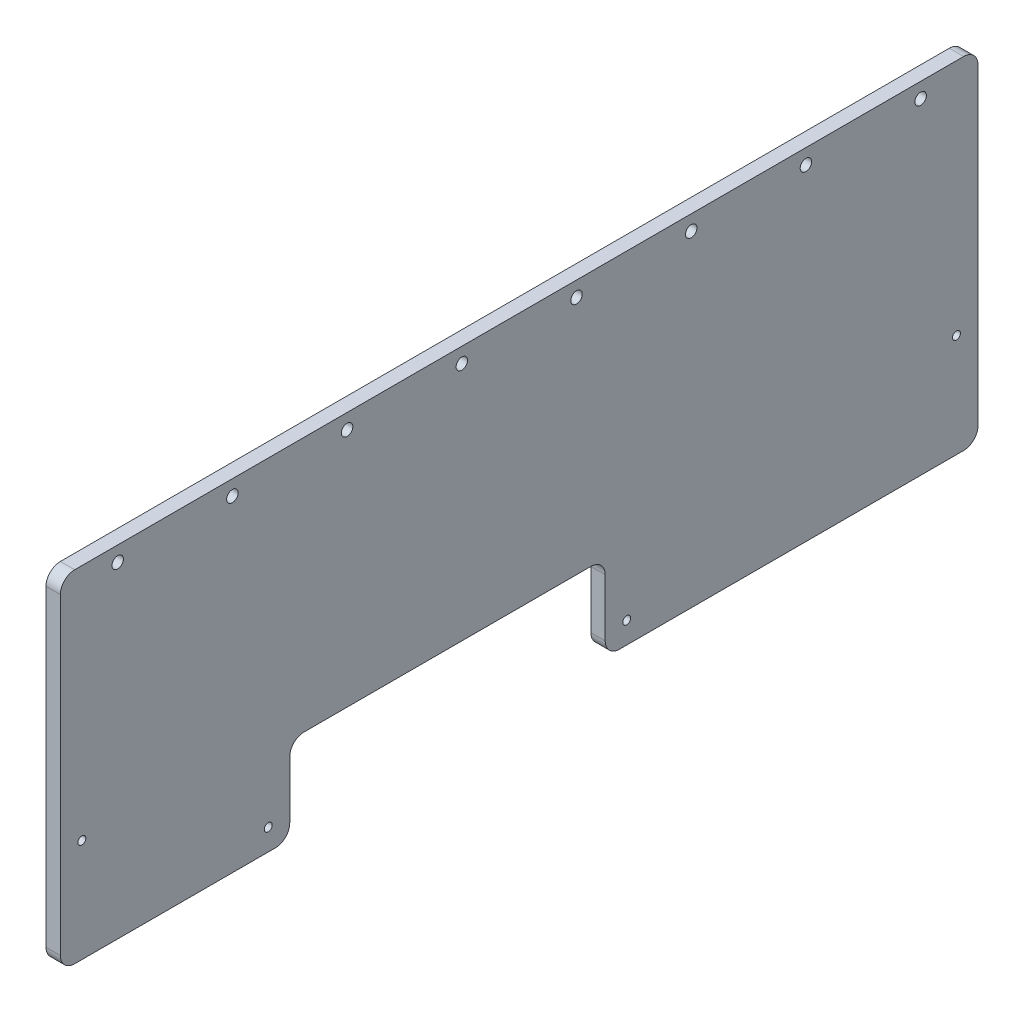
ISO-10303-21;
HEADER;
FILE_DESCRIPTION(('STEP AP214'),'2;1');
FILE_NAME('part.step','',(''),(''),'','','');
FILE_SCHEMA(('AUTOMOTIVE_DESIGN { 1 0 10303 214 1 1 1 1 }'));
ENDSEC;
DATA;
#1=APPLICATION_CONTEXT('core data for automotive mechanical design processes');
#2=APPLICATION_PROTOCOL_DEFINITION('international standard','automotive_design',2000,#1);
#3=PRODUCT_CONTEXT('',#1,'mechanical');
#4=PRODUCT('Part','Part','',(#3));
#5=PRODUCT_RELATED_PRODUCT_CATEGORY('part','',(#4));
#6=PRODUCT_DEFINITION_FORMATION('','',#4);
#7=PRODUCT_DEFINITION_CONTEXT('part definition',#1,'design');
#8=PRODUCT_DEFINITION('design','',#6,#7);
#9=PRODUCT_DEFINITION_SHAPE('','',#8);
#10=(LENGTH_UNIT() NAMED_UNIT(*) SI_UNIT(.MILLI.,.METRE.));
#11=(NAMED_UNIT(*) PLANE_ANGLE_UNIT() SI_UNIT($,.RADIAN.));
#12=(NAMED_UNIT(*) SI_UNIT($,.STERADIAN.) SOLID_ANGLE_UNIT());
#13=UNCERTAINTY_MEASURE_WITH_UNIT(LENGTH_MEASURE(1.E-05),#10,'distance_accuracy_value','');
#14=(GEOMETRIC_REPRESENTATION_CONTEXT(3) GLOBAL_UNCERTAINTY_ASSIGNED_CONTEXT((#13)) GLOBAL_UNIT_ASSIGNED_CONTEXT((#10,
#11,#12)) REPRESENTATION_CONTEXT('',''));
#15=CARTESIAN_POINT('',(0.,0.,0.));
#16=DIRECTION('',(0.,0.,1.));
#17=DIRECTION('',(1.,0.,0.));
#18=AXIS2_PLACEMENT_3D('',#15,#16,#17);
#19=CARTESIAN_POINT('',(0.,163.83,-419.1));
#20=DIRECTION('',(0.,1.,0.));
#21=DIRECTION('',(0.,0.,1.));
#22=AXIS2_PLACEMENT_3D('',#19,#20,#21);
#23=PLANE('',#22);
#24=DIRECTION('',(0.,0.,1.));
#25=VECTOR('',#24,1.);
#26=CARTESIAN_POINT('',(0.,163.83,-419.1));
#27=LINE('',#26,#25);
#28=CARTESIAN_POINT('',(0.,163.83,-412.75));
#29=VERTEX_POINT('',#28);
#30=CARTESIAN_POINT('',(0.,163.83,-19.05));
#31=VERTEX_POINT('',#30);
#32=EDGE_CURVE('E285',#29,#31,#27,.T.);
#33=ORIENTED_EDGE('',*,*,#32,.T.);
#34=DIRECTION('',(1.,0.,0.));
#35=VECTOR('',#34,1.);
#36=CARTESIAN_POINT('',(0.,163.83,-19.05));
#37=LINE('',#36,#35);
#38=CARTESIAN_POINT('',(6.35,163.83,-19.05));
#39=VERTEX_POINT('',#38);
#40=EDGE_CURVE('E167',#31,#39,#37,.T.);
#41=ORIENTED_EDGE('',*,*,#40,.T.);
#42=DIRECTION('',(0.,0.,1.));
#43=VECTOR('',#42,1.);
#44=CARTESIAN_POINT('',(6.35,163.83,-419.1));
#45=LINE('',#44,#43);
#46=CARTESIAN_POINT('',(6.35,163.83,-412.75));
#47=VERTEX_POINT('',#46);
#48=EDGE_CURVE('E151',#47,#39,#45,.T.);
#49=ORIENTED_EDGE('',*,*,#48,.F.);
#50=DIRECTION('',(1.,0.,0.));
#51=VECTOR('',#50,1.);
#52=CARTESIAN_POINT('',(0.,163.83,-412.75));
#53=LINE('',#52,#51);
#54=EDGE_CURVE('E164',#47,#29,#53,.F.);
#55=ORIENTED_EDGE('',*,*,#54,.T.);
#56=EDGE_LOOP('',(#33,#41,#49,#55));
#57=FACE_BOUND('',#56,.T.);
#58=ADVANCED_FACE('F34',(#57),#23,.T.);
#59=CARTESIAN_POINT('',(0.,12.7,-419.1));
#60=DIRECTION('',(0.,0.,-1.));
#61=DIRECTION('',(-1.,0.,0.));
#62=AXIS2_PLACEMENT_3D('',#59,#60,#61);
#63=PLANE('',#62);
#64=DIRECTION('',(0.,1.,0.));
#65=VECTOR('',#64,1.);
#66=CARTESIAN_POINT('',(0.,12.7,-419.1));
#67=LINE('',#66,#65);
#68=CARTESIAN_POINT('',(0.,19.05,-419.1));
#69=VERTEX_POINT('',#68);
#70=CARTESIAN_POINT('',(0.,157.48,-419.1));
#71=VERTEX_POINT('',#70);
#72=EDGE_CURVE('E174',#69,#71,#67,.T.);
#73=ORIENTED_EDGE('',*,*,#72,.T.);
#74=DIRECTION('',(1.,0.,0.));
#75=VECTOR('',#74,1.);
#76=CARTESIAN_POINT('',(0.,157.48,-419.1));
#77=LINE('',#76,#75);
#78=CARTESIAN_POINT('',(6.35,157.48,-419.1));
#79=VERTEX_POINT('',#78);
#80=EDGE_CURVE('E208',#71,#79,#77,.T.);
#81=ORIENTED_EDGE('',*,*,#80,.T.);
#82=DIRECTION('',(0.,1.,0.));
#83=VECTOR('',#82,1.);
#84=CARTESIAN_POINT('',(6.35,12.7,-419.1));
#85=LINE('',#84,#83);
#86=CARTESIAN_POINT('',(6.35,19.05,-419.1));
#87=VERTEX_POINT('',#86);
#88=EDGE_CURVE('E153',#87,#79,#85,.T.);
#89=ORIENTED_EDGE('',*,*,#88,.F.);
#90=DIRECTION('',(1.,0.,0.));
#91=VECTOR('',#90,1.);
#92=CARTESIAN_POINT('',(0.,19.05,-419.1));
#93=LINE('',#92,#91);
#94=EDGE_CURVE('E206',#87,#69,#93,.F.);
#95=ORIENTED_EDGE('',*,*,#94,.T.);
#96=EDGE_LOOP('',(#73,#81,#89,#95));
#97=FACE_BOUND('',#96,.T.);
#98=ADVANCED_FACE('F410',(#97),#63,.T.);
#99=CARTESIAN_POINT('',(0.,12.7,-254.));
#100=DIRECTION('',(0.,-1.,0.));
#101=DIRECTION('',(0.,0.,-1.));
#102=AXIS2_PLACEMENT_3D('',#99,#100,#101);
#103=PLANE('',#102);
#104=DIRECTION('',(0.,0.,-1.));
#105=VECTOR('',#104,1.);
#106=CARTESIAN_POINT('',(0.,12.7,-254.));
#107=LINE('',#106,#105);
#108=CARTESIAN_POINT('',(0.,12.7,-260.35));
#109=VERTEX_POINT('',#108);
#110=CARTESIAN_POINT('',(0.,12.7,-412.75));
#111=VERTEX_POINT('',#110);
#112=EDGE_CURVE('E179',#109,#111,#107,.T.);
#113=ORIENTED_EDGE('',*,*,#112,.T.);
#114=DIRECTION('',(1.,0.,0.));
#115=VECTOR('',#114,1.);
#116=CARTESIAN_POINT('',(0.,12.7,-412.75));
#117=LINE('',#116,#115);
#118=CARTESIAN_POINT('',(6.35,12.7,-412.75));
#119=VERTEX_POINT('',#118);
#120=EDGE_CURVE('E212',#111,#119,#117,.T.);
#121=ORIENTED_EDGE('',*,*,#120,.T.);
#122=DIRECTION('',(0.,0.,-1.));
#123=VECTOR('',#122,1.);
#124=CARTESIAN_POINT('',(6.35,12.7,-254.));
#125=LINE('',#124,#123);
#126=CARTESIAN_POINT('',(6.35,12.7,-260.35));
#127=VERTEX_POINT('',#126);
#128=EDGE_CURVE('E282',#127,#119,#125,.T.);
#129=ORIENTED_EDGE('',*,*,#128,.F.);
#130=DIRECTION('',(1.,0.,0.));
#131=VECTOR('',#130,1.);
#132=CARTESIAN_POINT('',(0.,12.7,-260.35));
#133=LINE('',#132,#131);
#134=EDGE_CURVE('E210',#127,#109,#133,.F.);
#135=ORIENTED_EDGE('',*,*,#134,.T.);
#136=EDGE_LOOP('',(#113,#121,#129,#135));
#137=FACE_BOUND('',#136,.T.);
#138=ADVANCED_FACE('F415',(#137),#103,.T.);
#139=CARTESIAN_POINT('',(0.,50.8,-254.));
#140=DIRECTION('',(0.,0.,1.));
#141=DIRECTION('',(1.,0.,0.));
#142=AXIS2_PLACEMENT_3D('',#139,#140,#141);
#143=PLANE('',#142);
#144=DIRECTION('',(0.,-1.,0.));
#145=VECTOR('',#144,1.);
#146=CARTESIAN_POINT('',(6.35,50.8,-254.));
#147=LINE('',#146,#145);
#148=CARTESIAN_POINT('',(6.35,44.45,-254.));
#149=VERTEX_POINT('',#148);
#150=CARTESIAN_POINT('',(6.35,19.05,-254.));
#151=VERTEX_POINT('',#150);
#152=EDGE_CURVE('E251',#149,#151,#147,.T.);
#153=ORIENTED_EDGE('',*,*,#152,.F.);
#154=DIRECTION('',(1.,0.,0.));
#155=VECTOR('',#154,1.);
#156=CARTESIAN_POINT('',(0.,44.45,-254.));
#157=LINE('',#156,#155);
#158=CARTESIAN_POINT('',(0.,44.45,-254.));
#159=VERTEX_POINT('',#158);
#160=EDGE_CURVE('E223',#149,#159,#157,.F.);
#161=ORIENTED_EDGE('',*,*,#160,.T.);
#162=DIRECTION('',(0.,-1.,0.));
#163=VECTOR('',#162,1.);
#164=CARTESIAN_POINT('',(0.,50.8,-254.));
#165=LINE('',#164,#163);
#166=CARTESIAN_POINT('',(0.,19.05,-254.));
#167=VERTEX_POINT('',#166);
#168=EDGE_CURVE('E265',#159,#167,#165,.T.);
#169=ORIENTED_EDGE('',*,*,#168,.T.);
#170=DIRECTION('',(1.,0.,0.));
#171=VECTOR('',#170,1.);
#172=CARTESIAN_POINT('',(0.,19.05,-254.));
#173=LINE('',#172,#171);
#174=EDGE_CURVE('E220',#167,#151,#173,.T.);
#175=ORIENTED_EDGE('',*,*,#174,.T.);
#176=EDGE_LOOP('',(#153,#161,#169,#175));
#177=FACE_BOUND('',#176,.T.);
#178=ADVANCED_FACE('F468',(#177),#143,.T.);
#179=CARTESIAN_POINT('',(0.,50.8,-114.3));
#180=DIRECTION('',(0.,-1.,0.));
#181=DIRECTION('',(0.,0.,-1.));
#182=AXIS2_PLACEMENT_3D('',#179,#180,#181);
#183=PLANE('',#182);
#184=DIRECTION('',(0.,0.,-1.));
#185=VECTOR('',#184,1.);
#186=CARTESIAN_POINT('',(0.,50.8,-114.3));
#187=LINE('',#186,#185);
#188=CARTESIAN_POINT('',(0.,50.8,-120.65));
#189=VERTEX_POINT('',#188);
#190=CARTESIAN_POINT('',(0.,50.8,-247.65));
#191=VERTEX_POINT('',#190);
#192=EDGE_CURVE('E259',#189,#191,#187,.T.);
#193=ORIENTED_EDGE('',*,*,#192,.T.);
#194=DIRECTION('',(1.,0.,0.));
#195=VECTOR('',#194,1.);
#196=CARTESIAN_POINT('',(6.35,50.8,-247.65));
#197=LINE('',#196,#195);
#198=CARTESIAN_POINT('',(6.35,50.8,-247.65));
#199=VERTEX_POINT('',#198);
#200=EDGE_CURVE('E217',#191,#199,#197,.T.);
#201=ORIENTED_EDGE('',*,*,#200,.T.);
#202=DIRECTION('',(0.,0.,-1.));
#203=VECTOR('',#202,1.);
#204=CARTESIAN_POINT('',(6.35,50.8,-114.3));
#205=LINE('',#204,#203);
#206=CARTESIAN_POINT('',(6.35,50.8,-120.65));
#207=VERTEX_POINT('',#206);
#208=EDGE_CURVE('E240',#207,#199,#205,.T.);
#209=ORIENTED_EDGE('',*,*,#208,.F.);
#210=DIRECTION('',(1.,0.,0.));
#211=VECTOR('',#210,1.);
#212=CARTESIAN_POINT('',(0.,50.8,-120.65));
#213=LINE('',#212,#211);
#214=EDGE_CURVE('E215',#207,#189,#213,.F.);
#215=ORIENTED_EDGE('',*,*,#214,.T.);
#216=EDGE_LOOP('',(#193,#201,#209,#215));
#217=FACE_BOUND('',#216,.T.);
#218=ADVANCED_FACE('F248',(#217),#183,.T.);
#219=CARTESIAN_POINT('',(0.,12.7,-114.3));
#220=DIRECTION('',(0.,0.,-1.));
#221=DIRECTION('',(0.,1.,0.));
#222=AXIS2_PLACEMENT_3D('',#219,#220,#221);
#223=PLANE('',#222);
#224=DIRECTION('',(0.,1.,0.));
#225=VECTOR('',#224,1.);
#226=CARTESIAN_POINT('',(0.,12.7,-114.3));
#227=LINE('',#226,#225);
#228=CARTESIAN_POINT('',(0.,19.05,-114.3));
#229=VERTEX_POINT('',#228);
#230=CARTESIAN_POINT('',(0.,44.45,-114.3));
#231=VERTEX_POINT('',#230);
#232=EDGE_CURVE('E258',#229,#231,#227,.T.);
#233=ORIENTED_EDGE('',*,*,#232,.T.);
#234=DIRECTION('',(1.,0.,0.));
#235=VECTOR('',#234,1.);
#236=CARTESIAN_POINT('',(6.35,44.45,-114.3));
#237=LINE('',#236,#235);
#238=CARTESIAN_POINT('',(6.35,44.45,-114.3));
#239=VERTEX_POINT('',#238);
#240=EDGE_CURVE('E227',#231,#239,#237,.T.);
#241=ORIENTED_EDGE('',*,*,#240,.T.);
#242=DIRECTION('',(0.,1.,0.));
#243=VECTOR('',#242,1.);
#244=CARTESIAN_POINT('',(6.35,12.7,-114.3));
#245=LINE('',#244,#243);
#246=CARTESIAN_POINT('',(6.35,19.05,-114.3));
#247=VERTEX_POINT('',#246);
#248=EDGE_CURVE('E242',#247,#239,#245,.T.);
#249=ORIENTED_EDGE('',*,*,#248,.F.);
#250=DIRECTION('',(1.,0.,0.));
#251=VECTOR('',#250,1.);
#252=CARTESIAN_POINT('',(0.,19.05,-114.3));
#253=LINE('',#252,#251);
#254=EDGE_CURVE('E225',#247,#229,#253,.F.);
#255=ORIENTED_EDGE('',*,*,#254,.T.);
#256=EDGE_LOOP('',(#233,#241,#249,#255));
#257=FACE_BOUND('',#256,.T.);
#258=ADVANCED_FACE('F261',(#257),#223,.T.);
#259=CARTESIAN_POINT('',(0.,12.7,-12.7));
#260=DIRECTION('',(0.,-1.,0.));
#261=DIRECTION('',(0.,0.,-1.));
#262=AXIS2_PLACEMENT_3D('',#259,#260,#261);
#263=PLANE('',#262);
#264=DIRECTION('',(0.,0.,-1.));
#265=VECTOR('',#264,1.);
#266=CARTESIAN_POINT('',(0.,12.7,-12.7));
#267=LINE('',#266,#265);
#268=CARTESIAN_POINT('',(0.,12.7,-19.05));
#269=VERTEX_POINT('',#268);
#270=CARTESIAN_POINT('',(0.,12.7,-107.95));
#271=VERTEX_POINT('',#270);
#272=EDGE_CURVE('E263',#269,#271,#267,.T.);
#273=ORIENTED_EDGE('',*,*,#272,.T.);
#274=DIRECTION('',(1.,0.,0.));
#275=VECTOR('',#274,1.);
#276=CARTESIAN_POINT('',(0.,12.7,-107.95));
#277=LINE('',#276,#275);
#278=CARTESIAN_POINT('',(6.35,12.7,-107.95));
#279=VERTEX_POINT('',#278);
#280=EDGE_CURVE('E231',#271,#279,#277,.T.);
#281=ORIENTED_EDGE('',*,*,#280,.T.);
#282=DIRECTION('',(0.,0.,-1.));
#283=VECTOR('',#282,1.);
#284=CARTESIAN_POINT('',(6.35,12.7,-12.7));
#285=LINE('',#284,#283);
#286=CARTESIAN_POINT('',(6.35,12.7,-19.05));
#287=VERTEX_POINT('',#286);
#288=EDGE_CURVE('E277',#287,#279,#285,.T.);
#289=ORIENTED_EDGE('',*,*,#288,.F.);
#290=DIRECTION('',(1.,0.,0.));
#291=VECTOR('',#290,1.);
#292=CARTESIAN_POINT('',(0.,12.7,-19.05));
#293=LINE('',#292,#291);
#294=EDGE_CURVE('E56',#287,#269,#293,.F.);
#295=ORIENTED_EDGE('',*,*,#294,.T.);
#296=EDGE_LOOP('',(#273,#281,#289,#295));
#297=FACE_BOUND('',#296,.T.);
#298=ADVANCED_FACE('F448',(#297),#263,.T.);
#299=CARTESIAN_POINT('',(0.,163.83,-12.7));
#300=DIRECTION('',(0.,0.,1.));
#301=DIRECTION('',(0.,-1.,0.));
#302=AXIS2_PLACEMENT_3D('',#299,#300,#301);
#303=PLANE('',#302);
#304=DIRECTION('',(0.,-1.,0.));
#305=VECTOR('',#304,1.);
#306=CARTESIAN_POINT('',(6.35,163.83,-12.7));
#307=LINE('',#306,#305);
#308=CARTESIAN_POINT('',(6.35,157.48,-12.7));
#309=VERTEX_POINT('',#308);
#310=CARTESIAN_POINT('',(6.35,19.05,-12.7));
#311=VERTEX_POINT('',#310);
#312=EDGE_CURVE('E168',#309,#311,#307,.T.);
#313=ORIENTED_EDGE('',*,*,#312,.F.);
#314=DIRECTION('',(1.,0.,0.));
#315=VECTOR('',#314,1.);
#316=CARTESIAN_POINT('',(0.,157.48,-12.7));
#317=LINE('',#316,#315);
#318=CARTESIAN_POINT('',(0.,157.48,-12.7));
#319=VERTEX_POINT('',#318);
#320=EDGE_CURVE('E194',#309,#319,#317,.F.);
#321=ORIENTED_EDGE('',*,*,#320,.T.);
#322=DIRECTION('',(0.,-1.,0.));
#323=VECTOR('',#322,1.);
#324=CARTESIAN_POINT('',(0.,163.83,-12.7));
#325=LINE('',#324,#323);
#326=CARTESIAN_POINT('',(0.,19.05,-12.7));
#327=VERTEX_POINT('',#326);
#328=EDGE_CURVE('E267',#319,#327,#325,.T.);
#329=ORIENTED_EDGE('',*,*,#328,.T.);
#330=DIRECTION('',(1.,0.,0.));
#331=VECTOR('',#330,1.);
#332=CARTESIAN_POINT('',(0.,19.05,-12.7));
#333=LINE('',#332,#331);
#334=EDGE_CURVE('E191',#327,#311,#333,.T.);
#335=ORIENTED_EDGE('',*,*,#334,.T.);
#336=EDGE_LOOP('',(#313,#321,#329,#335));
#337=FACE_BOUND('',#336,.T.);
#338=ADVANCED_FACE('F420',(#337),#303,.T.);
#339=CARTESIAN_POINT('',(0.,0.,0.));
#340=DIRECTION('',(1.,0.,0.));
#341=DIRECTION('',(0.,0.,-1.));
#342=AXIS2_PLACEMENT_3D('',#339,#340,#341);
#343=PLANE('',#342);
#344=CARTESIAN_POINT('',(0.,58.42,-409.575));
#345=DIRECTION('',(1.,0.,0.));
#346=DIRECTION('',(0.,0.,-1.));
#347=AXIS2_PLACEMENT_3D('',#344,#345,#346);
#348=CIRCLE('',#347,1.74999999999998);
#349=CARTESIAN_POINT('',(0.,58.42,-411.325));
#350=VERTEX_POINT('',#349);
#351=EDGE_CURVE('E352',#350,#350,#348,.T.);
#352=ORIENTED_EDGE('',*,*,#351,.T.);
#353=EDGE_LOOP('',(#352));
#354=FACE_BOUND('',#353,.T.);
#355=CARTESIAN_POINT('',(0.,22.225,-263.525));
#356=DIRECTION('',(1.,0.,0.));
#357=DIRECTION('',(0.,0.,-1.));
#358=AXIS2_PLACEMENT_3D('',#355,#356,#357);
#359=CIRCLE('',#358,1.74999999999998);
#360=CARTESIAN_POINT('',(0.,22.225,-265.275));
#361=VERTEX_POINT('',#360);
#362=EDGE_CURVE('E346',#361,#361,#359,.T.);
#363=ORIENTED_EDGE('',*,*,#362,.T.);
#364=EDGE_LOOP('',(#363));
#365=FACE_BOUND('',#364,.T.);
#366=CARTESIAN_POINT('',(0.,22.225,-104.775));
#367=DIRECTION('',(1.,0.,0.));
#368=DIRECTION('',(0.,0.,-1.));
#369=AXIS2_PLACEMENT_3D('',#366,#367,#368);
#370=CIRCLE('',#369,1.75);
#371=CARTESIAN_POINT('',(0.,22.225,-106.525));
#372=VERTEX_POINT('',#371);
#373=EDGE_CURVE('E340',#372,#372,#370,.T.);
#374=ORIENTED_EDGE('',*,*,#373,.T.);
#375=EDGE_LOOP('',(#374));
#376=FACE_BOUND('',#375,.T.);
#377=CARTESIAN_POINT('',(0.,58.42,-22.225));
#378=DIRECTION('',(1.,0.,0.));
#379=DIRECTION('',(0.,0.,-1.));
#380=AXIS2_PLACEMENT_3D('',#377,#378,#379);
#381=CIRCLE('',#380,1.75);
#382=CARTESIAN_POINT('',(0.,58.42,-23.975));
#383=VERTEX_POINT('',#382);
#384=EDGE_CURVE('E334',#383,#383,#381,.T.);
#385=ORIENTED_EDGE('',*,*,#384,.T.);
#386=EDGE_LOOP('',(#385));
#387=FACE_BOUND('',#386,.T.);
#388=CARTESIAN_POINT('',(0.,157.1625,-393.7));
#389=DIRECTION('',(1.,0.,0.));
#390=DIRECTION('',(0.,0.,-1.));
#391=AXIS2_PLACEMENT_3D('',#388,#389,#390);
#392=CIRCLE('',#391,2.54000000000001);
#393=CARTESIAN_POINT('',(0.,157.1625,-396.24));
#394=VERTEX_POINT('',#393);
#395=EDGE_CURVE('E328',#394,#394,#392,.T.);
#396=ORIENTED_EDGE('',*,*,#395,.T.);
#397=EDGE_LOOP('',(#396));
#398=FACE_BOUND('',#397,.T.);
#399=CARTESIAN_POINT('',(0.,157.1625,-342.9));
#400=DIRECTION('',(1.,0.,0.));
#401=DIRECTION('',(0.,0.,-1.));
#402=AXIS2_PLACEMENT_3D('',#399,#400,#401);
#403=CIRCLE('',#402,2.54000000000001);
#404=CARTESIAN_POINT('',(0.,157.1625,-345.44));
#405=VERTEX_POINT('',#404);
#406=EDGE_CURVE('E322',#405,#405,#403,.T.);
#407=ORIENTED_EDGE('',*,*,#406,.T.);
#408=EDGE_LOOP('',(#407));
#409=FACE_BOUND('',#408,.T.);
#410=CARTESIAN_POINT('',(0.,157.1625,-292.1));
#411=DIRECTION('',(1.,0.,0.));
#412=DIRECTION('',(0.,0.,-1.));
#413=AXIS2_PLACEMENT_3D('',#410,#411,#412);
#414=CIRCLE('',#413,2.54000000000001);
#415=CARTESIAN_POINT('',(0.,157.1625,-294.64));
#416=VERTEX_POINT('',#415);
#417=EDGE_CURVE('E316',#416,#416,#414,.T.);
#418=ORIENTED_EDGE('',*,*,#417,.T.);
#419=EDGE_LOOP('',(#418));
#420=FACE_BOUND('',#419,.T.);
#421=CARTESIAN_POINT('',(0.,157.1625,-241.3));
#422=DIRECTION('',(1.,0.,0.));
#423=DIRECTION('',(0.,0.,-1.));
#424=AXIS2_PLACEMENT_3D('',#421,#422,#423);
#425=CIRCLE('',#424,2.53999999999998);
#426=CARTESIAN_POINT('',(0.,157.1625,-243.84));
#427=VERTEX_POINT('',#426);
#428=EDGE_CURVE('E310',#427,#427,#425,.T.);
#429=ORIENTED_EDGE('',*,*,#428,.T.);
#430=EDGE_LOOP('',(#429));
#431=FACE_BOUND('',#430,.T.);
#432=CARTESIAN_POINT('',(0.,157.1625,-190.5));
#433=DIRECTION('',(1.,0.,0.));
#434=DIRECTION('',(0.,0.,-1.));
#435=AXIS2_PLACEMENT_3D('',#432,#433,#434);
#436=CIRCLE('',#435,2.53999999999998);
#437=CARTESIAN_POINT('',(0.,157.1625,-193.04));
#438=VERTEX_POINT('',#437);
#439=EDGE_CURVE('E304',#438,#438,#436,.T.);
#440=ORIENTED_EDGE('',*,*,#439,.T.);
#441=EDGE_LOOP('',(#440));
#442=FACE_BOUND('',#441,.T.);
#443=CARTESIAN_POINT('',(0.,157.1625,-139.7));
#444=DIRECTION('',(1.,0.,0.));
#445=DIRECTION('',(0.,0.,-1.));
#446=AXIS2_PLACEMENT_3D('',#443,#444,#445);
#447=CIRCLE('',#446,2.53999999999998);
#448=CARTESIAN_POINT('',(0.,157.1625,-142.24));
#449=VERTEX_POINT('',#448);
#450=EDGE_CURVE('E298',#449,#449,#447,.T.);
#451=ORIENTED_EDGE('',*,*,#450,.T.);
#452=EDGE_LOOP('',(#451));
#453=FACE_BOUND('',#452,.T.);
#454=CARTESIAN_POINT('',(0.,157.1625,-88.8999999999999));
#455=DIRECTION('',(1.,0.,0.));
#456=DIRECTION('',(0.,0.,-1.));
#457=AXIS2_PLACEMENT_3D('',#454,#455,#456);
#458=CIRCLE('',#457,2.54);
#459=CARTESIAN_POINT('',(0.,157.1625,-91.4399999999999));
#460=VERTEX_POINT('',#459);
#461=EDGE_CURVE('E292',#460,#460,#458,.T.);
#462=ORIENTED_EDGE('',*,*,#461,.T.);
#463=EDGE_LOOP('',(#462));
#464=FACE_BOUND('',#463,.T.);
#465=CARTESIAN_POINT('',(0.,157.1625,-38.1));
#466=DIRECTION('',(1.,0.,0.));
#467=DIRECTION('',(0.,0.,-1.));
#468=AXIS2_PLACEMENT_3D('',#465,#466,#467);
#469=CIRCLE('',#468,2.54000000000002);
#470=CARTESIAN_POINT('',(0.,157.1625,-40.64));
#471=VERTEX_POINT('',#470);
#472=EDGE_CURVE('E169',#471,#471,#469,.T.);
#473=ORIENTED_EDGE('',*,*,#472,.T.);
#474=EDGE_LOOP('',(#473));
#475=FACE_BOUND('',#474,.T.);
#476=ORIENTED_EDGE('',*,*,#328,.F.);
#477=CARTESIAN_POINT('',(0.,157.48,-19.05));
#478=DIRECTION('',(1.,0.,0.));
#479=DIRECTION('',(0.,0.,-1.));
#480=AXIS2_PLACEMENT_3D('',#477,#478,#479);
#481=CIRCLE('',#480,6.35);
#482=EDGE_CURVE('E204',#319,#31,#481,.F.);
#483=ORIENTED_EDGE('',*,*,#482,.T.);
#484=ORIENTED_EDGE('',*,*,#32,.F.);
#485=CARTESIAN_POINT('',(0.,157.48,-412.75));
#486=DIRECTION('',(1.,0.,0.));
#487=DIRECTION('',(0.,0.,-1.));
#488=AXIS2_PLACEMENT_3D('',#485,#486,#487);
#489=CIRCLE('',#488,6.35);
#490=EDGE_CURVE('E173',#29,#71,#489,.F.);
#491=ORIENTED_EDGE('',*,*,#490,.T.);
#492=ORIENTED_EDGE('',*,*,#72,.F.);
#493=CARTESIAN_POINT('',(0.,19.05,-412.75));
#494=DIRECTION('',(1.,0.,0.));
#495=DIRECTION('',(0.,0.,-1.));
#496=AXIS2_PLACEMENT_3D('',#493,#494,#495);
#497=CIRCLE('',#496,6.35);
#498=EDGE_CURVE('E201',#69,#111,#497,.F.);
#499=ORIENTED_EDGE('',*,*,#498,.T.);
#500=ORIENTED_EDGE('',*,*,#112,.F.);
#501=CARTESIAN_POINT('',(0.,19.05,-260.35));
#502=DIRECTION('',(1.,0.,0.));
#503=DIRECTION('',(0.,0.,-1.));
#504=AXIS2_PLACEMENT_3D('',#501,#502,#503);
#505=CIRCLE('',#504,6.35);
#506=EDGE_CURVE('E199',#109,#167,#505,.F.);
#507=ORIENTED_EDGE('',*,*,#506,.T.);
#508=ORIENTED_EDGE('',*,*,#168,.F.);
#509=CARTESIAN_POINT('',(0.,44.45,-247.65));
#510=DIRECTION('',(1.,0.,0.));
#511=DIRECTION('',(0.,0.,-1.));
#512=AXIS2_PLACEMENT_3D('',#509,#510,#511);
#513=CIRCLE('',#512,6.35);
#514=EDGE_CURVE('E236',#159,#191,#513,.T.);
#515=ORIENTED_EDGE('',*,*,#514,.T.);
#516=ORIENTED_EDGE('',*,*,#192,.F.);
#517=CARTESIAN_POINT('',(0.,44.45,-120.65));
#518=DIRECTION('',(1.,0.,0.));
#519=DIRECTION('',(0.,0.,-1.));
#520=AXIS2_PLACEMENT_3D('',#517,#518,#519);
#521=CIRCLE('',#520,6.35);
#522=EDGE_CURVE('E11',#189,#231,#521,.T.);
#523=ORIENTED_EDGE('',*,*,#522,.T.);
#524=ORIENTED_EDGE('',*,*,#232,.F.);
#525=CARTESIAN_POINT('',(0.,19.05,-107.95));
#526=DIRECTION('',(1.,0.,0.));
#527=DIRECTION('',(0.,0.,-1.));
#528=AXIS2_PLACEMENT_3D('',#525,#526,#527);
#529=CIRCLE('',#528,6.35);
#530=EDGE_CURVE('E49',#229,#271,#529,.F.);
#531=ORIENTED_EDGE('',*,*,#530,.T.);
#532=ORIENTED_EDGE('',*,*,#272,.F.);
#533=CARTESIAN_POINT('',(0.,19.05,-19.05));
#534=DIRECTION('',(1.,0.,0.));
#535=DIRECTION('',(0.,0.,-1.));
#536=AXIS2_PLACEMENT_3D('',#533,#534,#535);
#537=CIRCLE('',#536,6.35);
#538=EDGE_CURVE('E196',#269,#327,#537,.F.);
#539=ORIENTED_EDGE('',*,*,#538,.T.);
#540=EDGE_LOOP('',(#476,#483,#484,#491,#492,#499,#500,#507,#508,#515,#516,#523,#524,#531,#532,#539));
#541=FACE_BOUND('',#540,.T.);
#542=ADVANCED_FACE('F257',(#354,#365,#376,#387,#398,#409,#420,#431,#442,#453,#464,#475,#541),
#343,.F.);
#543=CARTESIAN_POINT('',(6.35,0.,0.));
#544=DIRECTION('',(1.,0.,0.));
#545=DIRECTION('',(0.,0.,-1.));
#546=AXIS2_PLACEMENT_3D('',#543,#544,#545);
#547=PLANE('',#546);
#548=CARTESIAN_POINT('',(6.35,58.42,-409.575));
#549=DIRECTION('',(1.,0.,0.));
#550=DIRECTION('',(0.,0.,-1.));
#551=AXIS2_PLACEMENT_3D('',#548,#549,#550);
#552=CIRCLE('',#551,1.74999999999998);
#553=CARTESIAN_POINT('',(6.35,58.42,-411.325));
#554=VERTEX_POINT('',#553);
#555=EDGE_CURVE('E355',#554,#554,#552,.T.);
#556=ORIENTED_EDGE('',*,*,#555,.F.);
#557=EDGE_LOOP('',(#556));
#558=FACE_BOUND('',#557,.T.);
#559=CARTESIAN_POINT('',(6.35,22.225,-263.525));
#560=DIRECTION('',(1.,0.,0.));
#561=DIRECTION('',(0.,0.,-1.));
#562=AXIS2_PLACEMENT_3D('',#559,#560,#561);
#563=CIRCLE('',#562,1.74999999999998);
#564=CARTESIAN_POINT('',(6.35,22.225,-265.275));
#565=VERTEX_POINT('',#564);
#566=EDGE_CURVE('E349',#565,#565,#563,.T.);
#567=ORIENTED_EDGE('',*,*,#566,.F.);
#568=EDGE_LOOP('',(#567));
#569=FACE_BOUND('',#568,.T.);
#570=CARTESIAN_POINT('',(6.35,22.225,-104.775));
#571=DIRECTION('',(1.,0.,0.));
#572=DIRECTION('',(0.,0.,-1.));
#573=AXIS2_PLACEMENT_3D('',#570,#571,#572);
#574=CIRCLE('',#573,1.75);
#575=CARTESIAN_POINT('',(6.35,22.225,-106.525));
#576=VERTEX_POINT('',#575);
#577=EDGE_CURVE('E343',#576,#576,#574,.T.);
#578=ORIENTED_EDGE('',*,*,#577,.F.);
#579=EDGE_LOOP('',(#578));
#580=FACE_BOUND('',#579,.T.);
#581=CARTESIAN_POINT('',(6.35,58.42,-22.225));
#582=DIRECTION('',(1.,0.,0.));
#583=DIRECTION('',(0.,0.,-1.));
#584=AXIS2_PLACEMENT_3D('',#581,#582,#583);
#585=CIRCLE('',#584,1.75);
#586=CARTESIAN_POINT('',(6.35,58.42,-23.975));
#587=VERTEX_POINT('',#586);
#588=EDGE_CURVE('E337',#587,#587,#585,.T.);
#589=ORIENTED_EDGE('',*,*,#588,.F.);
#590=EDGE_LOOP('',(#589));
#591=FACE_BOUND('',#590,.T.);
#592=CARTESIAN_POINT('',(6.35,157.1625,-393.7));
#593=DIRECTION('',(1.,0.,0.));
#594=DIRECTION('',(0.,0.,-1.));
#595=AXIS2_PLACEMENT_3D('',#592,#593,#594);
#596=CIRCLE('',#595,2.54000000000001);
#597=CARTESIAN_POINT('',(6.35,157.1625,-396.24));
#598=VERTEX_POINT('',#597);
#599=EDGE_CURVE('E331',#598,#598,#596,.T.);
#600=ORIENTED_EDGE('',*,*,#599,.F.);
#601=EDGE_LOOP('',(#600));
#602=FACE_BOUND('',#601,.T.);
#603=CARTESIAN_POINT('',(6.35,157.1625,-342.9));
#604=DIRECTION('',(1.,0.,0.));
#605=DIRECTION('',(0.,0.,-1.));
#606=AXIS2_PLACEMENT_3D('',#603,#604,#605);
#607=CIRCLE('',#606,2.54000000000001);
#608=CARTESIAN_POINT('',(6.35,157.1625,-345.44));
#609=VERTEX_POINT('',#608);
#610=EDGE_CURVE('E325',#609,#609,#607,.T.);
#611=ORIENTED_EDGE('',*,*,#610,.F.);
#612=EDGE_LOOP('',(#611));
#613=FACE_BOUND('',#612,.T.);
#614=CARTESIAN_POINT('',(6.35,157.1625,-292.1));
#615=DIRECTION('',(1.,0.,0.));
#616=DIRECTION('',(0.,0.,-1.));
#617=AXIS2_PLACEMENT_3D('',#614,#615,#616);
#618=CIRCLE('',#617,2.54000000000001);
#619=CARTESIAN_POINT('',(6.35,157.1625,-294.64));
#620=VERTEX_POINT('',#619);
#621=EDGE_CURVE('E319',#620,#620,#618,.T.);
#622=ORIENTED_EDGE('',*,*,#621,.F.);
#623=EDGE_LOOP('',(#622));
#624=FACE_BOUND('',#623,.T.);
#625=CARTESIAN_POINT('',(6.35,157.1625,-241.3));
#626=DIRECTION('',(1.,0.,0.));
#627=DIRECTION('',(0.,0.,-1.));
#628=AXIS2_PLACEMENT_3D('',#625,#626,#627);
#629=CIRCLE('',#628,2.53999999999998);
#630=CARTESIAN_POINT('',(6.35,157.1625,-243.84));
#631=VERTEX_POINT('',#630);
#632=EDGE_CURVE('E313',#631,#631,#629,.T.);
#633=ORIENTED_EDGE('',*,*,#632,.F.);
#634=EDGE_LOOP('',(#633));
#635=FACE_BOUND('',#634,.T.);
#636=CARTESIAN_POINT('',(6.35,157.1625,-190.5));
#637=DIRECTION('',(1.,0.,0.));
#638=DIRECTION('',(0.,0.,-1.));
#639=AXIS2_PLACEMENT_3D('',#636,#637,#638);
#640=CIRCLE('',#639,2.53999999999998);
#641=CARTESIAN_POINT('',(6.35,157.1625,-193.04));
#642=VERTEX_POINT('',#641);
#643=EDGE_CURVE('E307',#642,#642,#640,.T.);
#644=ORIENTED_EDGE('',*,*,#643,.F.);
#645=EDGE_LOOP('',(#644));
#646=FACE_BOUND('',#645,.T.);
#647=CARTESIAN_POINT('',(6.35,157.1625,-139.7));
#648=DIRECTION('',(1.,0.,0.));
#649=DIRECTION('',(0.,0.,-1.));
#650=AXIS2_PLACEMENT_3D('',#647,#648,#649);
#651=CIRCLE('',#650,2.53999999999998);
#652=CARTESIAN_POINT('',(6.35,157.1625,-142.24));
#653=VERTEX_POINT('',#652);
#654=EDGE_CURVE('E301',#653,#653,#651,.T.);
#655=ORIENTED_EDGE('',*,*,#654,.F.);
#656=EDGE_LOOP('',(#655));
#657=FACE_BOUND('',#656,.T.);
#658=CARTESIAN_POINT('',(6.35,157.1625,-88.8999999999999));
#659=DIRECTION('',(1.,0.,0.));
#660=DIRECTION('',(0.,0.,-1.));
#661=AXIS2_PLACEMENT_3D('',#658,#659,#660);
#662=CIRCLE('',#661,2.54);
#663=CARTESIAN_POINT('',(6.35,157.1625,-91.4399999999999));
#664=VERTEX_POINT('',#663);
#665=EDGE_CURVE('E295',#664,#664,#662,.T.);
#666=ORIENTED_EDGE('',*,*,#665,.F.);
#667=EDGE_LOOP('',(#666));
#668=FACE_BOUND('',#667,.T.);
#669=CARTESIAN_POINT('',(6.35,157.1625,-38.1));
#670=DIRECTION('',(1.,0.,0.));
#671=DIRECTION('',(0.,0.,-1.));
#672=AXIS2_PLACEMENT_3D('',#669,#670,#671);
#673=CIRCLE('',#672,2.54000000000002);
#674=CARTESIAN_POINT('',(6.35,157.1625,-40.64));
#675=VERTEX_POINT('',#674);
#676=EDGE_CURVE('E289',#675,#675,#673,.T.);
#677=ORIENTED_EDGE('',*,*,#676,.F.);
#678=EDGE_LOOP('',(#677));
#679=FACE_BOUND('',#678,.T.);
#680=ORIENTED_EDGE('',*,*,#48,.T.);
#681=CARTESIAN_POINT('',(6.35,157.48,-19.05));
#682=DIRECTION('',(1.,0.,0.));
#683=DIRECTION('',(0.,0.,-1.));
#684=AXIS2_PLACEMENT_3D('',#681,#682,#683);
#685=CIRCLE('',#684,6.35);
#686=EDGE_CURVE('E158',#39,#309,#685,.T.);
#687=ORIENTED_EDGE('',*,*,#686,.T.);
#688=ORIENTED_EDGE('',*,*,#312,.T.);
#689=CARTESIAN_POINT('',(6.35,19.05,-19.05));
#690=DIRECTION('',(1.,0.,0.));
#691=DIRECTION('',(0.,0.,-1.));
#692=AXIS2_PLACEMENT_3D('',#689,#690,#691);
#693=CIRCLE('',#692,6.35);
#694=EDGE_CURVE('E176',#311,#287,#693,.T.);
#695=ORIENTED_EDGE('',*,*,#694,.T.);
#696=ORIENTED_EDGE('',*,*,#288,.T.);
#697=CARTESIAN_POINT('',(6.35,19.05,-107.95));
#698=DIRECTION('',(1.,0.,0.));
#699=DIRECTION('',(0.,0.,-1.));
#700=AXIS2_PLACEMENT_3D('',#697,#698,#699);
#701=CIRCLE('',#700,6.35);
#702=EDGE_CURVE('E185',#279,#247,#701,.T.);
#703=ORIENTED_EDGE('',*,*,#702,.T.);
#704=ORIENTED_EDGE('',*,*,#248,.T.);
#705=CARTESIAN_POINT('',(6.35,44.45,-120.65));
#706=DIRECTION('',(1.,0.,0.));
#707=DIRECTION('',(0.,0.,-1.));
#708=AXIS2_PLACEMENT_3D('',#705,#706,#707);
#709=CIRCLE('',#708,6.35);
#710=EDGE_CURVE('E42',#239,#207,#709,.F.);
#711=ORIENTED_EDGE('',*,*,#710,.T.);
#712=ORIENTED_EDGE('',*,*,#208,.T.);
#713=CARTESIAN_POINT('',(6.35,44.45,-247.65));
#714=DIRECTION('',(1.,0.,0.));
#715=DIRECTION('',(0.,0.,-1.));
#716=AXIS2_PLACEMENT_3D('',#713,#714,#715);
#717=CIRCLE('',#716,6.35);
#718=EDGE_CURVE('E234',#199,#149,#717,.F.);
#719=ORIENTED_EDGE('',*,*,#718,.T.);
#720=ORIENTED_EDGE('',*,*,#152,.T.);
#721=CARTESIAN_POINT('',(6.35,19.05,-260.35));
#722=DIRECTION('',(1.,0.,0.));
#723=DIRECTION('',(0.,0.,-1.));
#724=AXIS2_PLACEMENT_3D('',#721,#722,#723);
#725=CIRCLE('',#724,6.35);
#726=EDGE_CURVE('E187',#151,#127,#725,.T.);
#727=ORIENTED_EDGE('',*,*,#726,.T.);
#728=ORIENTED_EDGE('',*,*,#128,.T.);
#729=CARTESIAN_POINT('',(6.35,19.05,-412.75));
#730=DIRECTION('',(1.,0.,0.));
#731=DIRECTION('',(0.,0.,-1.));
#732=AXIS2_PLACEMENT_3D('',#729,#730,#731);
#733=CIRCLE('',#732,6.35);
#734=EDGE_CURVE('E159',#119,#87,#733,.T.);
#735=ORIENTED_EDGE('',*,*,#734,.T.);
#736=ORIENTED_EDGE('',*,*,#88,.T.);
#737=CARTESIAN_POINT('',(6.35,157.48,-412.75));
#738=DIRECTION('',(1.,0.,0.));
#739=DIRECTION('',(0.,0.,-1.));
#740=AXIS2_PLACEMENT_3D('',#737,#738,#739);
#741=CIRCLE('',#740,6.35);
#742=EDGE_CURVE('E148',#79,#47,#741,.T.);
#743=ORIENTED_EDGE('',*,*,#742,.T.);
#744=EDGE_LOOP('',(#680,#687,#688,#695,#696,#703,#704,#711,#712,#719,#720,#727,#728,#735,#736,#743));
#745=FACE_BOUND('',#744,.T.);
#746=ADVANCED_FACE('F150',(#558,#569,#580,#591,#602,#613,#624,#635,#646,#657,#668,#679,#745),
#547,.T.);
#747=CARTESIAN_POINT('',(0.,157.1625,-38.1));
#748=DIRECTION('',(1.,0.,0.));
#749=DIRECTION('',(0.,0.,-1.));
#750=AXIS2_PLACEMENT_3D('',#747,#748,#749);
#751=CYLINDRICAL_SURFACE('',#750,2.54000000000002);
#752=ORIENTED_EDGE('',*,*,#472,.F.);
#753=EDGE_LOOP('',(#752));
#754=FACE_BOUND('',#753,.T.);
#755=ORIENTED_EDGE('',*,*,#676,.T.);
#756=EDGE_LOOP('',(#755));
#757=FACE_BOUND('',#756,.T.);
#758=ADVANCED_FACE('F373',(#754,#757),#751,.F.);
#759=CARTESIAN_POINT('',(0.,157.1625,-88.8999999999999));
#760=DIRECTION('',(1.,0.,0.));
#761=DIRECTION('',(0.,0.,-1.));
#762=AXIS2_PLACEMENT_3D('',#759,#760,#761);
#763=CYLINDRICAL_SURFACE('',#762,2.54);
#764=ORIENTED_EDGE('',*,*,#461,.F.);
#765=EDGE_LOOP('',(#764));
#766=FACE_BOUND('',#765,.T.);
#767=ORIENTED_EDGE('',*,*,#665,.T.);
#768=EDGE_LOOP('',(#767));
#769=FACE_BOUND('',#768,.T.);
#770=ADVANCED_FACE('F398',(#766,#769),#763,.F.);
#771=CARTESIAN_POINT('',(0.,157.1625,-139.7));
#772=DIRECTION('',(1.,0.,0.));
#773=DIRECTION('',(0.,0.,-1.));
#774=AXIS2_PLACEMENT_3D('',#771,#772,#773);
#775=CYLINDRICAL_SURFACE('',#774,2.53999999999998);
#776=ORIENTED_EDGE('',*,*,#450,.F.);
#777=EDGE_LOOP('',(#776));
#778=FACE_BOUND('',#777,.T.);
#779=ORIENTED_EDGE('',*,*,#654,.T.);
#780=EDGE_LOOP('',(#779));
#781=FACE_BOUND('',#780,.T.);
#782=ADVANCED_FACE('F404',(#778,#781),#775,.F.);
#783=CARTESIAN_POINT('',(0.,157.1625,-190.5));
#784=DIRECTION('',(1.,0.,0.));
#785=DIRECTION('',(0.,0.,-1.));
#786=AXIS2_PLACEMENT_3D('',#783,#784,#785);
#787=CYLINDRICAL_SURFACE('',#786,2.53999999999998);
#788=ORIENTED_EDGE('',*,*,#439,.F.);
#789=EDGE_LOOP('',(#788));
#790=FACE_BOUND('',#789,.T.);
#791=ORIENTED_EDGE('',*,*,#643,.T.);
#792=EDGE_LOOP('',(#791));
#793=FACE_BOUND('',#792,.T.);
#794=ADVANCED_FACE('F600',(#790,#793),#787,.F.);
#795=CARTESIAN_POINT('',(0.,157.1625,-241.3));
#796=DIRECTION('',(1.,0.,0.));
#797=DIRECTION('',(0.,0.,-1.));
#798=AXIS2_PLACEMENT_3D('',#795,#796,#797);
#799=CYLINDRICAL_SURFACE('',#798,2.53999999999998);
#800=ORIENTED_EDGE('',*,*,#428,.F.);
#801=EDGE_LOOP('',(#800));
#802=FACE_BOUND('',#801,.T.);
#803=ORIENTED_EDGE('',*,*,#632,.T.);
#804=EDGE_LOOP('',(#803));
#805=FACE_BOUND('',#804,.T.);
#806=ADVANCED_FACE('F592',(#802,#805),#799,.F.);
#807=CARTESIAN_POINT('',(0.,157.1625,-292.1));
#808=DIRECTION('',(1.,0.,0.));
#809=DIRECTION('',(0.,0.,-1.));
#810=AXIS2_PLACEMENT_3D('',#807,#808,#809);
#811=CYLINDRICAL_SURFACE('',#810,2.54000000000001);
#812=ORIENTED_EDGE('',*,*,#417,.F.);
#813=EDGE_LOOP('',(#812));
#814=FACE_BOUND('',#813,.T.);
#815=ORIENTED_EDGE('',*,*,#621,.T.);
#816=EDGE_LOOP('',(#815));
#817=FACE_BOUND('',#816,.T.);
#818=ADVANCED_FACE('F584',(#814,#817),#811,.F.);
#819=CARTESIAN_POINT('',(0.,157.1625,-342.9));
#820=DIRECTION('',(1.,0.,0.));
#821=DIRECTION('',(0.,0.,-1.));
#822=AXIS2_PLACEMENT_3D('',#819,#820,#821);
#823=CYLINDRICAL_SURFACE('',#822,2.54000000000001);
#824=ORIENTED_EDGE('',*,*,#406,.F.);
#825=EDGE_LOOP('',(#824));
#826=FACE_BOUND('',#825,.T.);
#827=ORIENTED_EDGE('',*,*,#610,.T.);
#828=EDGE_LOOP('',(#827));
#829=FACE_BOUND('',#828,.T.);
#830=ADVANCED_FACE('F576',(#826,#829),#823,.F.);
#831=CARTESIAN_POINT('',(0.,157.1625,-393.7));
#832=DIRECTION('',(1.,0.,0.));
#833=DIRECTION('',(0.,0.,-1.));
#834=AXIS2_PLACEMENT_3D('',#831,#832,#833);
#835=CYLINDRICAL_SURFACE('',#834,2.54000000000001);
#836=ORIENTED_EDGE('',*,*,#395,.F.);
#837=EDGE_LOOP('',(#836));
#838=FACE_BOUND('',#837,.T.);
#839=ORIENTED_EDGE('',*,*,#599,.T.);
#840=EDGE_LOOP('',(#839));
#841=FACE_BOUND('',#840,.T.);
#842=ADVANCED_FACE('F568',(#838,#841),#835,.F.);
#843=CARTESIAN_POINT('',(0.,58.42,-22.225));
#844=DIRECTION('',(1.,0.,0.));
#845=DIRECTION('',(0.,0.,-1.));
#846=AXIS2_PLACEMENT_3D('',#843,#844,#845);
#847=CYLINDRICAL_SURFACE('',#846,1.75);
#848=ORIENTED_EDGE('',*,*,#384,.F.);
#849=EDGE_LOOP('',(#848));
#850=FACE_BOUND('',#849,.T.);
#851=ORIENTED_EDGE('',*,*,#588,.T.);
#852=EDGE_LOOP('',(#851));
#853=FACE_BOUND('',#852,.T.);
#854=ADVANCED_FACE('F560',(#850,#853),#847,.F.);
#855=CARTESIAN_POINT('',(0.,22.225,-104.775));
#856=DIRECTION('',(1.,0.,0.));
#857=DIRECTION('',(0.,0.,-1.));
#858=AXIS2_PLACEMENT_3D('',#855,#856,#857);
#859=CYLINDRICAL_SURFACE('',#858,1.75);
#860=ORIENTED_EDGE('',*,*,#373,.F.);
#861=EDGE_LOOP('',(#860));
#862=FACE_BOUND('',#861,.T.);
#863=ORIENTED_EDGE('',*,*,#577,.T.);
#864=EDGE_LOOP('',(#863));
#865=FACE_BOUND('',#864,.T.);
#866=ADVANCED_FACE('F552',(#862,#865),#859,.F.);
#867=CARTESIAN_POINT('',(0.,22.225,-263.525));
#868=DIRECTION('',(1.,0.,0.));
#869=DIRECTION('',(0.,0.,-1.));
#870=AXIS2_PLACEMENT_3D('',#867,#868,#869);
#871=CYLINDRICAL_SURFACE('',#870,1.74999999999998);
#872=ORIENTED_EDGE('',*,*,#362,.F.);
#873=EDGE_LOOP('',(#872));
#874=FACE_BOUND('',#873,.T.);
#875=ORIENTED_EDGE('',*,*,#566,.T.);
#876=EDGE_LOOP('',(#875));
#877=FACE_BOUND('',#876,.T.);
#878=ADVANCED_FACE('F367',(#874,#877),#871,.F.);
#879=CARTESIAN_POINT('',(0.,58.42,-409.575));
#880=DIRECTION('',(1.,0.,0.));
#881=DIRECTION('',(0.,0.,-1.));
#882=AXIS2_PLACEMENT_3D('',#879,#880,#881);
#883=CYLINDRICAL_SURFACE('',#882,1.74999999999998);
#884=ORIENTED_EDGE('',*,*,#351,.F.);
#885=EDGE_LOOP('',(#884));
#886=FACE_BOUND('',#885,.T.);
#887=ORIENTED_EDGE('',*,*,#555,.T.);
#888=EDGE_LOOP('',(#887));
#889=FACE_BOUND('',#888,.T.);
#890=ADVANCED_FACE('F363',(#886,#889),#883,.F.);
#891=CARTESIAN_POINT('',(0.,157.48,-19.05));
#892=DIRECTION('',(1.,0.,0.));
#893=DIRECTION('',(0.,0.,-1.));
#894=AXIS2_PLACEMENT_3D('',#891,#892,#893);
#895=CYLINDRICAL_SURFACE('',#894,6.35);
#896=ORIENTED_EDGE('',*,*,#482,.F.);
#897=ORIENTED_EDGE('',*,*,#320,.F.);
#898=ORIENTED_EDGE('',*,*,#686,.F.);
#899=ORIENTED_EDGE('',*,*,#40,.F.);
#900=EDGE_LOOP('',(#896,#897,#898,#899));
#901=FACE_BOUND('',#900,.T.);
#902=ADVANCED_FACE('F366',(#901),#895,.T.);
#903=CARTESIAN_POINT('',(0.,157.48,-412.75));
#904=DIRECTION('',(1.,0.,0.));
#905=DIRECTION('',(0.,0.,-1.));
#906=AXIS2_PLACEMENT_3D('',#903,#904,#905);
#907=CYLINDRICAL_SURFACE('',#906,6.35);
#908=ORIENTED_EDGE('',*,*,#490,.F.);
#909=ORIENTED_EDGE('',*,*,#54,.F.);
#910=ORIENTED_EDGE('',*,*,#742,.F.);
#911=ORIENTED_EDGE('',*,*,#80,.F.);
#912=EDGE_LOOP('',(#908,#909,#910,#911));
#913=FACE_BOUND('',#912,.T.);
#914=ADVANCED_FACE('F172',(#913),#907,.T.);
#915=CARTESIAN_POINT('',(0.,19.05,-412.75));
#916=DIRECTION('',(1.,0.,0.));
#917=DIRECTION('',(0.,0.,-1.));
#918=AXIS2_PLACEMENT_3D('',#915,#916,#917);
#919=CYLINDRICAL_SURFACE('',#918,6.35);
#920=ORIENTED_EDGE('',*,*,#498,.F.);
#921=ORIENTED_EDGE('',*,*,#94,.F.);
#922=ORIENTED_EDGE('',*,*,#734,.F.);
#923=ORIENTED_EDGE('',*,*,#120,.F.);
#924=EDGE_LOOP('',(#920,#921,#922,#923));
#925=FACE_BOUND('',#924,.T.);
#926=ADVANCED_FACE('F427',(#925),#919,.T.);
#927=CARTESIAN_POINT('',(0.,44.45,-247.65));
#928=DIRECTION('',(-1.,0.,0.));
#929=DIRECTION('',(0.,0.,1.));
#930=AXIS2_PLACEMENT_3D('',#927,#928,#929);
#931=CYLINDRICAL_SURFACE('',#930,6.35);
#932=ORIENTED_EDGE('',*,*,#514,.F.);
#933=ORIENTED_EDGE('',*,*,#160,.F.);
#934=ORIENTED_EDGE('',*,*,#718,.F.);
#935=ORIENTED_EDGE('',*,*,#200,.F.);
#936=EDGE_LOOP('',(#932,#933,#934,#935));
#937=FACE_BOUND('',#936,.T.);
#938=ADVANCED_FACE('F430',(#937),#931,.F.);
#939=CARTESIAN_POINT('',(0.,19.05,-260.35));
#940=DIRECTION('',(1.,0.,0.));
#941=DIRECTION('',(0.,0.,-1.));
#942=AXIS2_PLACEMENT_3D('',#939,#940,#941);
#943=CYLINDRICAL_SURFACE('',#942,6.35);
#944=ORIENTED_EDGE('',*,*,#506,.F.);
#945=ORIENTED_EDGE('',*,*,#134,.F.);
#946=ORIENTED_EDGE('',*,*,#726,.F.);
#947=ORIENTED_EDGE('',*,*,#174,.F.);
#948=EDGE_LOOP('',(#944,#945,#946,#947));
#949=FACE_BOUND('',#948,.T.);
#950=ADVANCED_FACE('F434',(#949),#943,.T.);
#951=CARTESIAN_POINT('',(0.,44.45,-120.65));
#952=DIRECTION('',(-1.,0.,0.));
#953=DIRECTION('',(0.,0.,1.));
#954=AXIS2_PLACEMENT_3D('',#951,#952,#953);
#955=CYLINDRICAL_SURFACE('',#954,6.35);
#956=ORIENTED_EDGE('',*,*,#522,.F.);
#957=ORIENTED_EDGE('',*,*,#214,.F.);
#958=ORIENTED_EDGE('',*,*,#710,.F.);
#959=ORIENTED_EDGE('',*,*,#240,.F.);
#960=EDGE_LOOP('',(#956,#957,#958,#959));
#961=FACE_BOUND('',#960,.T.);
#962=ADVANCED_FACE('F254',(#961),#955,.F.);
#963=CARTESIAN_POINT('',(0.,19.05,-107.95));
#964=DIRECTION('',(1.,0.,0.));
#965=DIRECTION('',(0.,0.,-1.));
#966=AXIS2_PLACEMENT_3D('',#963,#964,#965);
#967=CYLINDRICAL_SURFACE('',#966,6.35);
#968=ORIENTED_EDGE('',*,*,#530,.F.);
#969=ORIENTED_EDGE('',*,*,#254,.F.);
#970=ORIENTED_EDGE('',*,*,#702,.F.);
#971=ORIENTED_EDGE('',*,*,#280,.F.);
#972=EDGE_LOOP('',(#968,#969,#970,#971));
#973=FACE_BOUND('',#972,.T.);
#974=ADVANCED_FACE('F440',(#973),#967,.T.);
#975=CARTESIAN_POINT('',(0.,19.05,-19.05));
#976=DIRECTION('',(1.,0.,0.));
#977=DIRECTION('',(0.,0.,-1.));
#978=AXIS2_PLACEMENT_3D('',#975,#976,#977);
#979=CYLINDRICAL_SURFACE('',#978,6.35);
#980=ORIENTED_EDGE('',*,*,#538,.F.);
#981=ORIENTED_EDGE('',*,*,#294,.F.);
#982=ORIENTED_EDGE('',*,*,#694,.F.);
#983=ORIENTED_EDGE('',*,*,#334,.F.);
#984=EDGE_LOOP('',(#980,#981,#982,#983));
#985=FACE_BOUND('',#984,.T.);
#986=ADVANCED_FACE('F36',(#985),#979,.T.);
#987=CLOSED_SHELL('',(#58,#98,#138,#178,#218,#258,#298,#338,#542,#746,#758,#770,#782,#794,#806,
#818,#830,#842,#854,#866,#878,#890,#902,#914,#926,#938,#950,#962,#974,#986));
#988=MANIFOLD_SOLID_BREP('B2',#987);
#989=ADVANCED_BREP_SHAPE_REPRESENTATION('',(#18,#988),#14);
#990=SHAPE_DEFINITION_REPRESENTATION(#9,#989);
ENDSEC;
END-ISO-10303-21;
